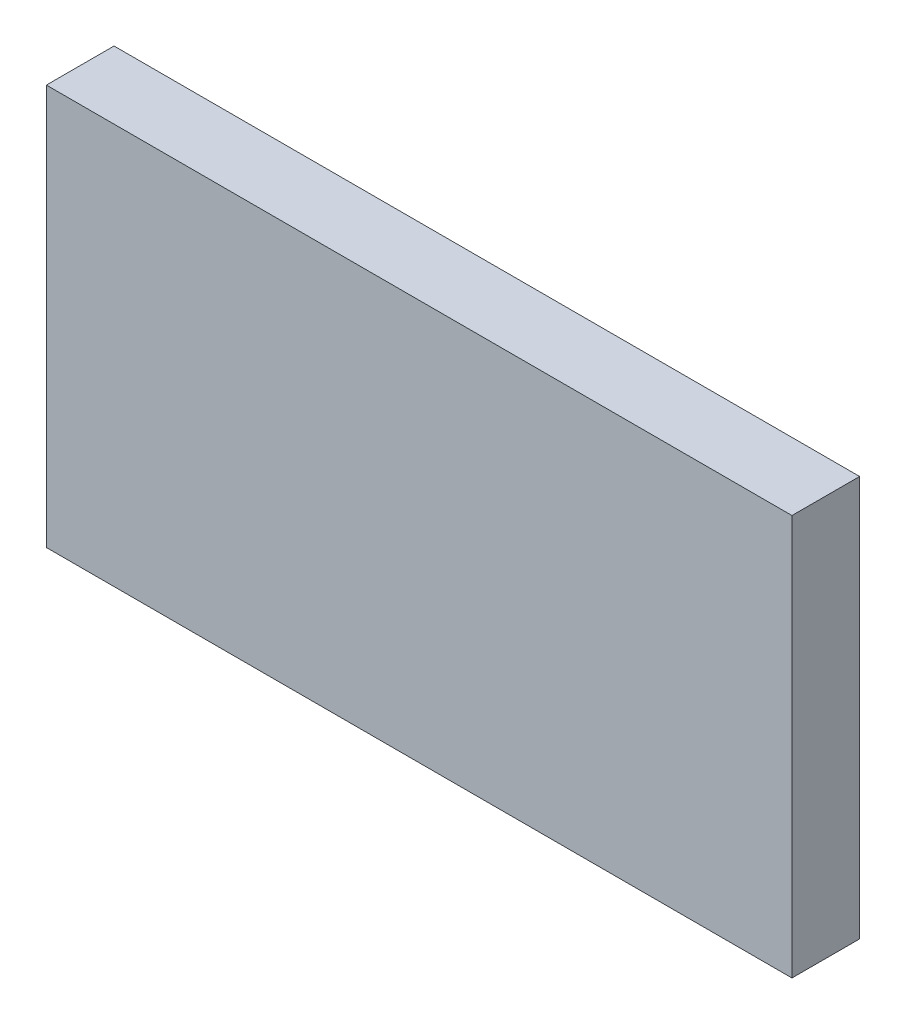
ISO-10303-21;
HEADER;
FILE_DESCRIPTION(('STEP AP214'),'2;1');
FILE_NAME('part.step','',(''),(''),'','','');
FILE_SCHEMA(('AUTOMOTIVE_DESIGN { 1 0 10303 214 1 1 1 1 }'));
ENDSEC;
DATA;
#1=APPLICATION_CONTEXT('core data for automotive mechanical design processes');
#2=APPLICATION_PROTOCOL_DEFINITION('international standard','automotive_design',2000,#1);
#3=PRODUCT_CONTEXT('',#1,'mechanical');
#4=PRODUCT('Part','Part','',(#3));
#5=PRODUCT_RELATED_PRODUCT_CATEGORY('part','',(#4));
#6=PRODUCT_DEFINITION_FORMATION('','',#4);
#7=PRODUCT_DEFINITION_CONTEXT('part definition',#1,'design');
#8=PRODUCT_DEFINITION('design','',#6,#7);
#9=PRODUCT_DEFINITION_SHAPE('','',#8);
#10=(LENGTH_UNIT() NAMED_UNIT(*) SI_UNIT(.MILLI.,.METRE.));
#11=(NAMED_UNIT(*) PLANE_ANGLE_UNIT() SI_UNIT($,.RADIAN.));
#12=(NAMED_UNIT(*) SI_UNIT($,.STERADIAN.) SOLID_ANGLE_UNIT());
#13=UNCERTAINTY_MEASURE_WITH_UNIT(LENGTH_MEASURE(1.E-05),#10,'distance_accuracy_value','');
#14=(GEOMETRIC_REPRESENTATION_CONTEXT(3) GLOBAL_UNCERTAINTY_ASSIGNED_CONTEXT((#13)) GLOBAL_UNIT_ASSIGNED_CONTEXT((#10,
#11,#12)) REPRESENTATION_CONTEXT('',''));
#15=CARTESIAN_POINT('',(0.,0.,0.));
#16=DIRECTION('',(0.,0.,1.));
#17=DIRECTION('',(1.,0.,0.));
#18=AXIS2_PLACEMENT_3D('',#15,#16,#17);
#19=CARTESIAN_POINT('',(-0.551,1.629,0.));
#20=DIRECTION('',(1.,0.,0.));
#21=DIRECTION('',(0.,0.,1.));
#22=AXIS2_PLACEMENT_3D('',#19,#20,#21);
#23=PLANE('',#22);
#24=DIRECTION('',(0.,1.,0.));
#25=VECTOR('',#24,1.);
#26=CARTESIAN_POINT('',(-0.551,1.629,0.1));
#27=LINE('',#26,#25);
#28=CARTESIAN_POINT('',(-0.551,1.629,0.1));
#29=VERTEX_POINT('',#28);
#30=CARTESIAN_POINT('',(-0.551,2.221,0.1));
#31=VERTEX_POINT('',#30);
#32=EDGE_CURVE('E11',#29,#31,#27,.T.);
#33=ORIENTED_EDGE('',*,*,#32,.T.);
#34=DIRECTION('',(0.,0.,1.));
#35=VECTOR('',#34,1.);
#36=CARTESIAN_POINT('',(-0.551,2.221,0.));
#37=LINE('',#36,#35);
#38=CARTESIAN_POINT('',(-0.551,2.221,0.));
#39=VERTEX_POINT('',#38);
#40=EDGE_CURVE('E24',#39,#31,#37,.T.);
#41=ORIENTED_EDGE('',*,*,#40,.F.);
#42=DIRECTION('',(0.,1.,0.));
#43=VECTOR('',#42,1.);
#44=CARTESIAN_POINT('',(-0.551,1.629,0.));
#45=LINE('',#44,#43);
#46=CARTESIAN_POINT('',(-0.551,1.629,0.));
#47=VERTEX_POINT('',#46);
#48=EDGE_CURVE('E86',#47,#39,#45,.T.);
#49=ORIENTED_EDGE('',*,*,#48,.F.);
#50=DIRECTION('',(0.,0.,1.));
#51=VECTOR('',#50,1.);
#52=CARTESIAN_POINT('',(-0.551,1.629,0.));
#53=LINE('',#52,#51);
#54=EDGE_CURVE('E36',#47,#29,#53,.T.);
#55=ORIENTED_EDGE('',*,*,#54,.T.);
#56=EDGE_LOOP('',(#33,#41,#49,#55));
#57=FACE_BOUND('',#56,.T.);
#58=ADVANCED_FACE('F17',(#57),#23,.F.);
#59=CARTESIAN_POINT('',(0.551,1.629,0.));
#60=DIRECTION('',(1.,0.,0.));
#61=DIRECTION('',(0.,0.,1.));
#62=AXIS2_PLACEMENT_3D('',#59,#60,#61);
#63=PLANE('',#62);
#64=DIRECTION('',(0.,0.,1.));
#65=VECTOR('',#64,1.);
#66=CARTESIAN_POINT('',(0.551,1.629,0.));
#67=LINE('',#66,#65);
#68=CARTESIAN_POINT('',(0.551,1.629,0.));
#69=VERTEX_POINT('',#68);
#70=CARTESIAN_POINT('',(0.551,1.629,0.1));
#71=VERTEX_POINT('',#70);
#72=EDGE_CURVE('E83',#69,#71,#67,.T.);
#73=ORIENTED_EDGE('',*,*,#72,.F.);
#74=DIRECTION('',(0.,1.,0.));
#75=VECTOR('',#74,1.);
#76=CARTESIAN_POINT('',(0.551,1.629,0.));
#77=LINE('',#76,#75);
#78=CARTESIAN_POINT('',(0.551,2.221,0.));
#79=VERTEX_POINT('',#78);
#80=EDGE_CURVE('E63',#69,#79,#77,.T.);
#81=ORIENTED_EDGE('',*,*,#80,.T.);
#82=DIRECTION('',(0.,0.,1.));
#83=VECTOR('',#82,1.);
#84=CARTESIAN_POINT('',(0.551,2.221,0.));
#85=LINE('',#84,#83);
#86=CARTESIAN_POINT('',(0.551,2.221,0.1));
#87=VERTEX_POINT('',#86);
#88=EDGE_CURVE('E57',#79,#87,#85,.T.);
#89=ORIENTED_EDGE('',*,*,#88,.T.);
#90=DIRECTION('',(0.,1.,0.));
#91=VECTOR('',#90,1.);
#92=CARTESIAN_POINT('',(0.551,1.629,0.1));
#93=LINE('',#92,#91);
#94=EDGE_CURVE('E60',#71,#87,#93,.T.);
#95=ORIENTED_EDGE('',*,*,#94,.F.);
#96=EDGE_LOOP('',(#73,#81,#89,#95));
#97=FACE_BOUND('',#96,.T.);
#98=ADVANCED_FACE('F59',(#97),#63,.T.);
#99=CARTESIAN_POINT('',(-0.551,1.629,0.));
#100=DIRECTION('',(0.,1.,0.));
#101=DIRECTION('',(0.,0.,1.));
#102=AXIS2_PLACEMENT_3D('',#99,#100,#101);
#103=PLANE('',#102);
#104=ORIENTED_EDGE('',*,*,#72,.T.);
#105=DIRECTION('',(1.,0.,0.));
#106=VECTOR('',#105,1.);
#107=CARTESIAN_POINT('',(-0.551,1.629,0.1));
#108=LINE('',#107,#106);
#109=EDGE_CURVE('E71',#29,#71,#108,.T.);
#110=ORIENTED_EDGE('',*,*,#109,.F.);
#111=ORIENTED_EDGE('',*,*,#54,.F.);
#112=DIRECTION('',(1.,0.,0.));
#113=VECTOR('',#112,1.);
#114=CARTESIAN_POINT('',(-0.551,1.629,0.));
#115=LINE('',#114,#113);
#116=EDGE_CURVE('E76',#47,#69,#115,.T.);
#117=ORIENTED_EDGE('',*,*,#116,.T.);
#118=EDGE_LOOP('',(#104,#110,#111,#117));
#119=FACE_BOUND('',#118,.T.);
#120=ADVANCED_FACE('F91',(#119),#103,.F.);
#121=CARTESIAN_POINT('',(-0.551,2.221,0.));
#122=DIRECTION('',(0.,1.,0.));
#123=DIRECTION('',(0.,0.,1.));
#124=AXIS2_PLACEMENT_3D('',#121,#122,#123);
#125=PLANE('',#124);
#126=DIRECTION('',(1.,0.,0.));
#127=VECTOR('',#126,1.);
#128=CARTESIAN_POINT('',(-0.551,2.221,0.));
#129=LINE('',#128,#127);
#130=EDGE_CURVE('E74',#39,#79,#129,.T.);
#131=ORIENTED_EDGE('',*,*,#130,.F.);
#132=ORIENTED_EDGE('',*,*,#40,.T.);
#133=DIRECTION('',(1.,0.,0.));
#134=VECTOR('',#133,1.);
#135=CARTESIAN_POINT('',(-0.551,2.221,0.1));
#136=LINE('',#135,#134);
#137=EDGE_CURVE('E69',#31,#87,#136,.T.);
#138=ORIENTED_EDGE('',*,*,#137,.T.);
#139=ORIENTED_EDGE('',*,*,#88,.F.);
#140=EDGE_LOOP('',(#131,#132,#138,#139));
#141=FACE_BOUND('',#140,.T.);
#142=ADVANCED_FACE('F73',(#141),#125,.T.);
#143=CARTESIAN_POINT('',(-0.551,1.629,0.));
#144=DIRECTION('',(0.,0.,1.));
#145=DIRECTION('',(1.,0.,0.));
#146=AXIS2_PLACEMENT_3D('',#143,#144,#145);
#147=PLANE('',#146);
#148=ORIENTED_EDGE('',*,*,#130,.T.);
#149=ORIENTED_EDGE('',*,*,#80,.F.);
#150=ORIENTED_EDGE('',*,*,#116,.F.);
#151=ORIENTED_EDGE('',*,*,#48,.T.);
#152=EDGE_LOOP('',(#148,#149,#150,#151));
#153=FACE_BOUND('',#152,.T.);
#154=ADVANCED_FACE('F89',(#153),#147,.F.);
#155=CARTESIAN_POINT('',(-0.551,1.629,0.1));
#156=DIRECTION('',(0.,0.,1.));
#157=DIRECTION('',(1.,0.,0.));
#158=AXIS2_PLACEMENT_3D('',#155,#156,#157);
#159=PLANE('',#158);
#160=ORIENTED_EDGE('',*,*,#32,.F.);
#161=ORIENTED_EDGE('',*,*,#109,.T.);
#162=ORIENTED_EDGE('',*,*,#94,.T.);
#163=ORIENTED_EDGE('',*,*,#137,.F.);
#164=EDGE_LOOP('',(#160,#161,#162,#163));
#165=FACE_BOUND('',#164,.T.);
#166=ADVANCED_FACE('F68',(#165),#159,.T.);
#167=CLOSED_SHELL('',(#58,#98,#120,#142,#154,#166));
#168=MANIFOLD_SOLID_BREP('B1',#167);
#169=ADVANCED_BREP_SHAPE_REPRESENTATION('',(#18,#168),#14);
#170=SHAPE_DEFINITION_REPRESENTATION(#9,#169);
ENDSEC;
END-ISO-10303-21;
